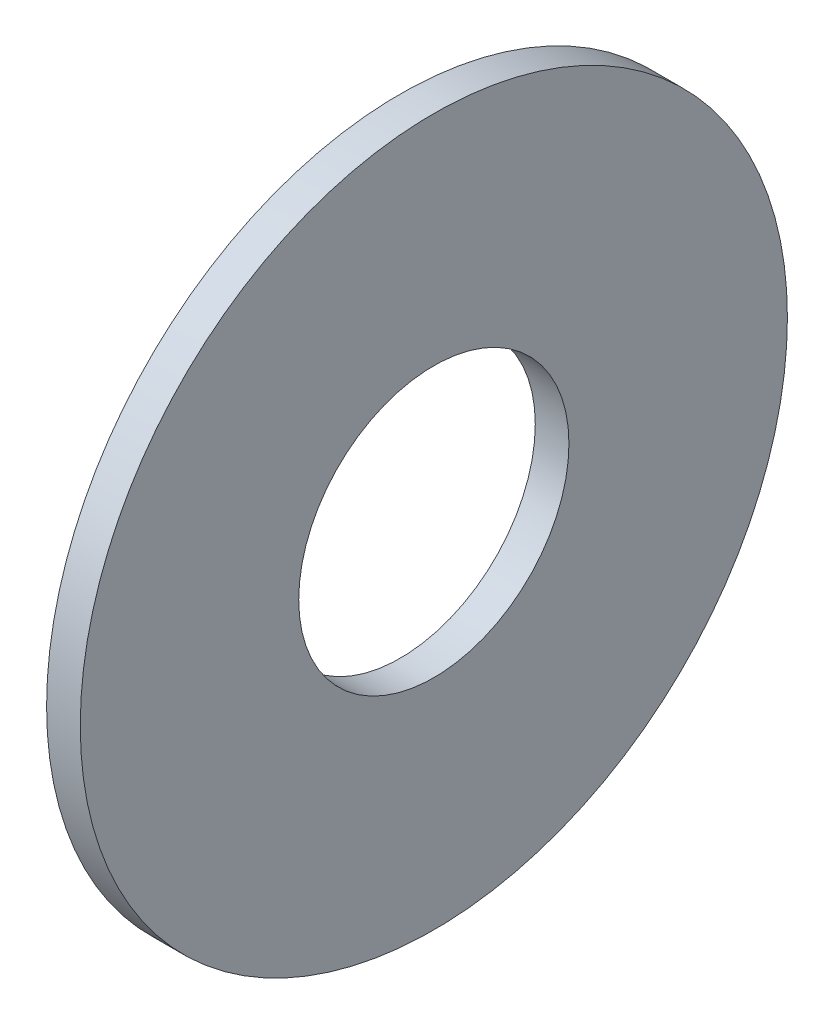
ISO-10303-21;
HEADER;
FILE_DESCRIPTION(('STEP AP214'),'2;1');
FILE_NAME('part.step','',(''),(''),'','','');
FILE_SCHEMA(('AUTOMOTIVE_DESIGN { 1 0 10303 214 1 1 1 1 }'));
ENDSEC;
DATA;
#1=APPLICATION_CONTEXT('core data for automotive mechanical design processes');
#2=APPLICATION_PROTOCOL_DEFINITION('international standard','automotive_design',2000,#1);
#3=PRODUCT_CONTEXT('',#1,'mechanical');
#4=PRODUCT('Part','Part','',(#3));
#5=PRODUCT_RELATED_PRODUCT_CATEGORY('part','',(#4));
#6=PRODUCT_DEFINITION_FORMATION('','',#4);
#7=PRODUCT_DEFINITION_CONTEXT('part definition',#1,'design');
#8=PRODUCT_DEFINITION('design','',#6,#7);
#9=PRODUCT_DEFINITION_SHAPE('','',#8);
#10=(LENGTH_UNIT() NAMED_UNIT(*) SI_UNIT(.MILLI.,.METRE.));
#11=(NAMED_UNIT(*) PLANE_ANGLE_UNIT() SI_UNIT($,.RADIAN.));
#12=(NAMED_UNIT(*) SI_UNIT($,.STERADIAN.) SOLID_ANGLE_UNIT());
#13=UNCERTAINTY_MEASURE_WITH_UNIT(LENGTH_MEASURE(1.E-05),#10,'distance_accuracy_value','');
#14=(GEOMETRIC_REPRESENTATION_CONTEXT(3) GLOBAL_UNCERTAINTY_ASSIGNED_CONTEXT((#13)) GLOBAL_UNIT_ASSIGNED_CONTEXT((#10,
#11,#12)) REPRESENTATION_CONTEXT('',''));
#15=CARTESIAN_POINT('',(0.,0.,0.));
#16=DIRECTION('',(0.,0.,1.));
#17=DIRECTION('',(1.,0.,0.));
#18=AXIS2_PLACEMENT_3D('',#15,#16,#17);
#19=CARTESIAN_POINT('',(0.499999999999975,0.,0.));
#20=DIRECTION('',(1.,0.,0.));
#21=DIRECTION('',(0.,0.,-1.));
#22=AXIS2_PLACEMENT_3D('',#19,#20,#21);
#23=PLANE('',#22);
#24=CARTESIAN_POINT('',(0.499999999999975,0.,0.));
#25=DIRECTION('',(1.,0.,0.));
#26=DIRECTION('',(0.,0.,-1.));
#27=AXIS2_PLACEMENT_3D('',#24,#25,#26);
#28=CIRCLE('',#27,10.5);
#29=CARTESIAN_POINT('',(0.499999999999975,0.,-10.5));
#30=VERTEX_POINT('',#29);
#31=EDGE_CURVE('E10',#30,#30,#28,.T.);
#32=ORIENTED_EDGE('',*,*,#31,.T.);
#33=EDGE_LOOP('',(#32));
#34=FACE_BOUND('',#33,.T.);
#35=CARTESIAN_POINT('',(0.499999999999975,0.,0.));
#36=DIRECTION('',(1.,0.,0.));
#37=DIRECTION('',(0.,0.,-1.));
#38=AXIS2_PLACEMENT_3D('',#35,#36,#37);
#39=CIRCLE('',#38,4.0125);
#40=CARTESIAN_POINT('',(0.499999999999975,0.,-4.0125));
#41=VERTEX_POINT('',#40);
#42=EDGE_CURVE('E37',#41,#41,#39,.T.);
#43=ORIENTED_EDGE('',*,*,#42,.F.);
#44=EDGE_LOOP('',(#43));
#45=FACE_BOUND('',#44,.T.);
#46=ADVANCED_FACE('F30',(#34,#45),#23,.T.);
#47=CARTESIAN_POINT('',(0.499999999999975,0.,0.));
#48=DIRECTION('',(-1.,0.,0.));
#49=DIRECTION('',(0.,0.,1.));
#50=AXIS2_PLACEMENT_3D('',#47,#48,#49);
#51=CYLINDRICAL_SURFACE('',#50,10.5);
#52=ORIENTED_EDGE('',*,*,#31,.F.);
#53=EDGE_LOOP('',(#52));
#54=FACE_BOUND('',#53,.T.);
#55=CARTESIAN_POINT('',(-0.500000000000025,0.,0.));
#56=DIRECTION('',(1.,0.,0.));
#57=DIRECTION('',(0.,0.,-1.));
#58=AXIS2_PLACEMENT_3D('',#55,#56,#57);
#59=CIRCLE('',#58,10.5);
#60=CARTESIAN_POINT('',(-0.500000000000025,0.,-10.5));
#61=VERTEX_POINT('',#60);
#62=EDGE_CURVE('E41',#61,#61,#59,.T.);
#63=ORIENTED_EDGE('',*,*,#62,.T.);
#64=EDGE_LOOP('',(#63));
#65=FACE_BOUND('',#64,.T.);
#66=ADVANCED_FACE('F32',(#54,#65),#51,.T.);
#67=CARTESIAN_POINT('',(0.499999999999975,0.,0.));
#68=DIRECTION('',(-1.,0.,0.));
#69=DIRECTION('',(0.,0.,1.));
#70=AXIS2_PLACEMENT_3D('',#67,#68,#69);
#71=CYLINDRICAL_SURFACE('',#70,4.0125);
#72=ORIENTED_EDGE('',*,*,#42,.T.);
#73=EDGE_LOOP('',(#72));
#74=FACE_BOUND('',#73,.T.);
#75=CARTESIAN_POINT('',(-0.500000000000025,0.,0.));
#76=DIRECTION('',(1.,0.,0.));
#77=DIRECTION('',(0.,0.,-1.));
#78=AXIS2_PLACEMENT_3D('',#75,#76,#77);
#79=CIRCLE('',#78,4.0125);
#80=CARTESIAN_POINT('',(-0.500000000000025,0.,-4.0125));
#81=VERTEX_POINT('',#80);
#82=EDGE_CURVE('E45',#81,#81,#79,.T.);
#83=ORIENTED_EDGE('',*,*,#82,.F.);
#84=EDGE_LOOP('',(#83));
#85=FACE_BOUND('',#84,.T.);
#86=ADVANCED_FACE('F54',(#74,#85),#71,.F.);
#87=CARTESIAN_POINT('',(-0.500000000000025,0.,0.));
#88=DIRECTION('',(1.,0.,0.));
#89=DIRECTION('',(0.,0.,-1.));
#90=AXIS2_PLACEMENT_3D('',#87,#88,#89);
#91=PLANE('',#90);
#92=ORIENTED_EDGE('',*,*,#82,.T.);
#93=EDGE_LOOP('',(#92));
#94=FACE_BOUND('',#93,.T.);
#95=ORIENTED_EDGE('',*,*,#62,.F.);
#96=EDGE_LOOP('',(#95));
#97=FACE_BOUND('',#96,.T.);
#98=ADVANCED_FACE('F51',(#94,#97),#91,.F.);
#99=CLOSED_SHELL('',(#46,#66,#86,#98));
#100=MANIFOLD_SOLID_BREP('B2',#99);
#101=ADVANCED_BREP_SHAPE_REPRESENTATION('',(#18,#100),#14);
#102=SHAPE_DEFINITION_REPRESENTATION(#9,#101);
ENDSEC;
END-ISO-10303-21;
